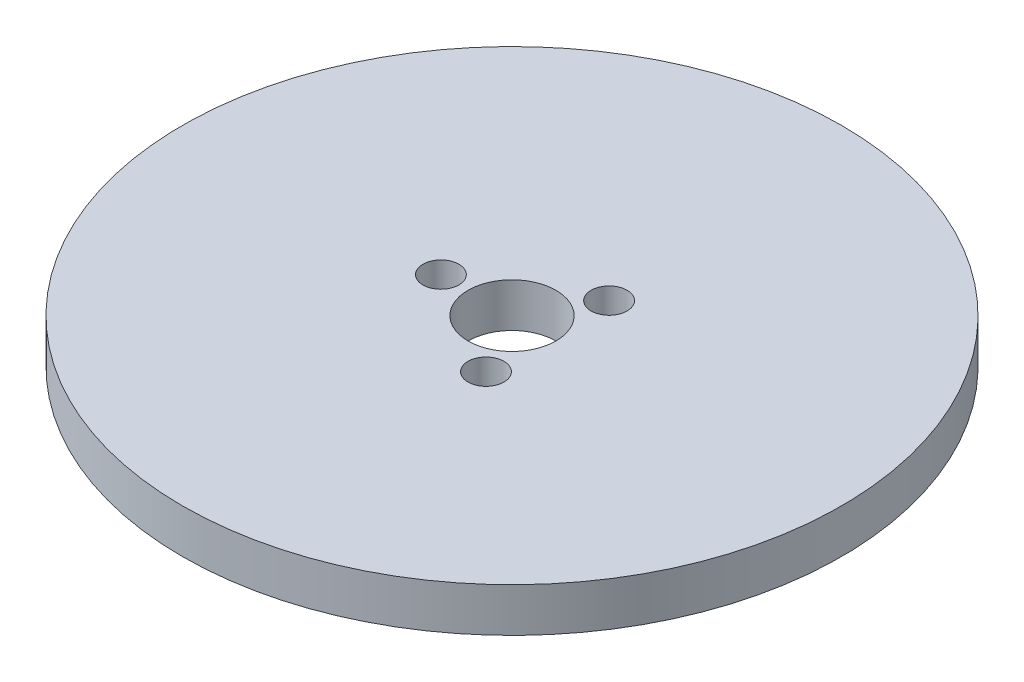
ISO-10303-21;
HEADER;
FILE_DESCRIPTION(('STEP AP214'),'2;1');
FILE_NAME('part.step','',(''),(''),'','','');
FILE_SCHEMA(('AUTOMOTIVE_DESIGN { 1 0 10303 214 1 1 1 1 }'));
ENDSEC;
DATA;
#1=APPLICATION_CONTEXT('core data for automotive mechanical design processes');
#2=APPLICATION_PROTOCOL_DEFINITION('international standard','automotive_design',2000,#1);
#3=PRODUCT_CONTEXT('',#1,'mechanical');
#4=PRODUCT('Part','Part','',(#3));
#5=PRODUCT_RELATED_PRODUCT_CATEGORY('part','',(#4));
#6=PRODUCT_DEFINITION_FORMATION('','',#4);
#7=PRODUCT_DEFINITION_CONTEXT('part definition',#1,'design');
#8=PRODUCT_DEFINITION('design','',#6,#7);
#9=PRODUCT_DEFINITION_SHAPE('','',#8);
#10=(LENGTH_UNIT() NAMED_UNIT(*) SI_UNIT(.MILLI.,.METRE.));
#11=(NAMED_UNIT(*) PLANE_ANGLE_UNIT() SI_UNIT($,.RADIAN.));
#12=(NAMED_UNIT(*) SI_UNIT($,.STERADIAN.) SOLID_ANGLE_UNIT());
#13=UNCERTAINTY_MEASURE_WITH_UNIT(LENGTH_MEASURE(1.E-05),#10,'distance_accuracy_value','');
#14=(GEOMETRIC_REPRESENTATION_CONTEXT(3) GLOBAL_UNCERTAINTY_ASSIGNED_CONTEXT((#13)) GLOBAL_UNIT_ASSIGNED_CONTEXT((#10,
#11,#12)) REPRESENTATION_CONTEXT('',''));
#15=CARTESIAN_POINT('',(0.,0.,0.));
#16=DIRECTION('',(0.,0.,1.));
#17=DIRECTION('',(1.,0.,0.));
#18=AXIS2_PLACEMENT_3D('',#15,#16,#17);
#19=CARTESIAN_POINT('',(0.,10.,0.));
#20=DIRECTION('',(0.,-1.,0.));
#21=DIRECTION('',(0.,0.,-1.));
#22=AXIS2_PLACEMENT_3D('',#19,#20,#21);
#23=CYLINDRICAL_SURFACE('',#22,75.);
#24=CARTESIAN_POINT('',(0.,10.,0.));
#25=DIRECTION('',(0.,1.,0.));
#26=DIRECTION('',(0.,0.,1.));
#27=AXIS2_PLACEMENT_3D('',#24,#25,#26);
#28=CIRCLE('',#27,75.);
#29=CARTESIAN_POINT('',(0.,10.,75.));
#30=VERTEX_POINT('',#29);
#31=EDGE_CURVE('E10',#30,#30,#28,.T.);
#32=ORIENTED_EDGE('',*,*,#31,.F.);
#33=EDGE_LOOP('',(#32));
#34=FACE_BOUND('',#33,.T.);
#35=CARTESIAN_POINT('',(0.,0.,0.));
#36=DIRECTION('',(0.,1.,0.));
#37=DIRECTION('',(0.,0.,1.));
#38=AXIS2_PLACEMENT_3D('',#35,#36,#37);
#39=CIRCLE('',#38,75.);
#40=CARTESIAN_POINT('',(0.,0.,75.));
#41=VERTEX_POINT('',#40);
#42=EDGE_CURVE('E37',#41,#41,#39,.T.);
#43=ORIENTED_EDGE('',*,*,#42,.T.);
#44=EDGE_LOOP('',(#43));
#45=FACE_BOUND('',#44,.T.);
#46=ADVANCED_FACE('F40',(#34,#45),#23,.T.);
#47=CARTESIAN_POINT('',(0.,10.,0.));
#48=DIRECTION('',(0.,1.,0.));
#49=DIRECTION('',(0.,0.,1.));
#50=AXIS2_PLACEMENT_3D('',#47,#48,#49);
#51=PLANE('',#50);
#52=CARTESIAN_POINT('',(8.08851748673285,10.,14.0097232449305));
#53=DIRECTION('',(0.,1.,0.));
#54=DIRECTION('',(0.866025403784436,0.,-0.500000000000004));
#55=AXIS2_PLACEMENT_3D('',#52,#53,#54);
#56=CIRCLE('',#55,4.09381448176856);
#57=CARTESIAN_POINT('',(11.633864826325,10.,11.9628160040462));
#58=VERTEX_POINT('',#57);
#59=EDGE_CURVE('E70',#58,#58,#56,.T.);
#60=ORIENTED_EDGE('',*,*,#59,.F.);
#61=EDGE_LOOP('',(#60));
#62=FACE_BOUND('',#61,.T.);
#63=CARTESIAN_POINT('',(8.08851748673266,10.,-14.0097232449306));
#64=DIRECTION('',(0.,1.,0.));
#65=DIRECTION('',(-0.866025403784443,0.,-0.499999999999992));
#66=AXIS2_PLACEMENT_3D('',#63,#64,#65);
#67=CIRCLE('',#66,4.09381448176856);
#68=CARTESIAN_POINT('',(4.54317014714044,10.,-16.0566304858148));
#69=VERTEX_POINT('',#68);
#70=EDGE_CURVE('E61',#69,#69,#67,.T.);
#71=ORIENTED_EDGE('',*,*,#70,.F.);
#72=EDGE_LOOP('',(#71));
#73=FACE_BOUND('',#72,.T.);
#74=CARTESIAN_POINT('',(-16.1770349734656,10.,0.));
#75=DIRECTION('',(0.,1.,0.));
#76=DIRECTION('',(0.,0.,1.));
#77=AXIS2_PLACEMENT_3D('',#74,#75,#76);
#78=CIRCLE('',#77,4.09381448176856);
#79=CARTESIAN_POINT('',(-16.1770349734656,10.,4.09381448176856));
#80=VERTEX_POINT('',#79);
#81=EDGE_CURVE('E54',#80,#80,#78,.T.);
#82=ORIENTED_EDGE('',*,*,#81,.F.);
#83=EDGE_LOOP('',(#82));
#84=FACE_BOUND('',#83,.T.);
#85=CARTESIAN_POINT('',(0.,10.,0.));
#86=DIRECTION('',(0.,1.,0.));
#87=DIRECTION('',(0.,0.,1.));
#88=AXIS2_PLACEMENT_3D('',#85,#86,#87);
#89=CIRCLE('',#88,10.);
#90=CARTESIAN_POINT('',(0.,10.,10.));
#91=VERTEX_POINT('',#90);
#92=EDGE_CURVE('E50',#91,#91,#89,.T.);
#93=ORIENTED_EDGE('',*,*,#92,.F.);
#94=EDGE_LOOP('',(#93));
#95=FACE_BOUND('',#94,.T.);
#96=ORIENTED_EDGE('',*,*,#31,.T.);
#97=EDGE_LOOP('',(#96));
#98=FACE_BOUND('',#97,.T.);
#99=ADVANCED_FACE('F85',(#62,#73,#84,#95,#98),#51,.T.);
#100=CARTESIAN_POINT('',(0.,0.,0.));
#101=DIRECTION('',(0.,1.,0.));
#102=DIRECTION('',(0.,0.,1.));
#103=AXIS2_PLACEMENT_3D('',#100,#101,#102);
#104=PLANE('',#103);
#105=CARTESIAN_POINT('',(0.,0.,0.));
#106=DIRECTION('',(0.,1.,0.));
#107=DIRECTION('',(0.,0.,1.));
#108=AXIS2_PLACEMENT_3D('',#105,#106,#107);
#109=CIRCLE('',#108,10.);
#110=CARTESIAN_POINT('',(0.,0.,10.));
#111=VERTEX_POINT('',#110);
#112=EDGE_CURVE('E47',#111,#111,#109,.T.);
#113=ORIENTED_EDGE('',*,*,#112,.T.);
#114=EDGE_LOOP('',(#113));
#115=FACE_BOUND('',#114,.T.);
#116=ORIENTED_EDGE('',*,*,#42,.F.);
#117=EDGE_LOOP('',(#116));
#118=FACE_BOUND('',#117,.T.);
#119=ADVANCED_FACE('F84',(#115,#118),#104,.F.);
#120=CARTESIAN_POINT('',(0.,10.,0.));
#121=DIRECTION('',(0.,-1.,0.));
#122=DIRECTION('',(0.,0.,-1.));
#123=AXIS2_PLACEMENT_3D('',#120,#121,#122);
#124=CYLINDRICAL_SURFACE('',#123,10.);
#125=ORIENTED_EDGE('',*,*,#92,.T.);
#126=EDGE_LOOP('',(#125));
#127=FACE_BOUND('',#126,.T.);
#128=ORIENTED_EDGE('',*,*,#112,.F.);
#129=EDGE_LOOP('',(#128));
#130=FACE_BOUND('',#129,.T.);
#131=ADVANCED_FACE('F91',(#127,#130),#124,.F.);
#132=CARTESIAN_POINT('',(-16.1770349734656,3.95859087083147,0.));
#133=DIRECTION('',(0.,1.,0.));
#134=DIRECTION('',(0.,0.,1.));
#135=AXIS2_PLACEMENT_3D('',#132,#133,#134);
#136=CYLINDRICAL_SURFACE('',#135,4.09381448176856);
#137=CARTESIAN_POINT('',(-16.1770349734656,3.95859087083147,0.));
#138=DIRECTION('',(0.,1.,0.));
#139=DIRECTION('',(0.,0.,1.));
#140=AXIS2_PLACEMENT_3D('',#137,#138,#139);
#141=CIRCLE('',#140,4.09381448176856);
#142=CARTESIAN_POINT('',(-16.1770349734656,3.95859087083147,4.09381448176856));
#143=VERTEX_POINT('',#142);
#144=EDGE_CURVE('E55',#143,#143,#141,.T.);
#145=ORIENTED_EDGE('',*,*,#144,.F.);
#146=EDGE_LOOP('',(#145));
#147=FACE_BOUND('',#146,.T.);
#148=ORIENTED_EDGE('',*,*,#81,.T.);
#149=EDGE_LOOP('',(#148));
#150=FACE_BOUND('',#149,.T.);
#151=ADVANCED_FACE('F96',(#147,#150),#136,.F.);
#152=CARTESIAN_POINT('',(-16.1770349734656,3.95859087083147,0.));
#153=DIRECTION('',(0.,1.,0.));
#154=DIRECTION('',(0.,0.,1.));
#155=AXIS2_PLACEMENT_3D('',#152,#153,#154);
#156=PLANE('',#155);
#157=ORIENTED_EDGE('',*,*,#144,.T.);
#158=EDGE_LOOP('',(#157));
#159=FACE_BOUND('',#158,.T.);
#160=ADVANCED_FACE('F127',(#159),#156,.T.);
#161=CARTESIAN_POINT('',(8.08851748673266,3.95859087083147,-14.0097232449306));
#162=DIRECTION('',(0.,1.,0.));
#163=DIRECTION('',(0.,0.,1.));
#164=AXIS2_PLACEMENT_3D('',#161,#162,#163);
#165=CYLINDRICAL_SURFACE('',#164,4.09381448176856);
#166=CARTESIAN_POINT('',(8.08851748673266,3.95859087083147,-14.0097232449306));
#167=DIRECTION('',(0.,1.,0.));
#168=DIRECTION('',(-0.866025403784443,0.,-0.499999999999992));
#169=AXIS2_PLACEMENT_3D('',#166,#167,#168);
#170=CIRCLE('',#169,4.09381448176856);
#171=CARTESIAN_POINT('',(4.54317014714044,3.95859087083147,-16.0566304858148));
#172=VERTEX_POINT('',#171);
#173=EDGE_CURVE('E63',#172,#172,#170,.T.);
#174=ORIENTED_EDGE('',*,*,#173,.F.);
#175=EDGE_LOOP('',(#174));
#176=FACE_BOUND('',#175,.T.);
#177=ORIENTED_EDGE('',*,*,#70,.T.);
#178=EDGE_LOOP('',(#177));
#179=FACE_BOUND('',#178,.T.);
#180=ADVANCED_FACE('F133',(#176,#179),#165,.F.);
#181=CARTESIAN_POINT('',(8.08851748673266,3.95859087083147,-14.0097232449306));
#182=DIRECTION('',(0.,1.,0.));
#183=DIRECTION('',(-0.866025403784443,0.,-0.499999999999992));
#184=AXIS2_PLACEMENT_3D('',#181,#182,#183);
#185=PLANE('',#184);
#186=ORIENTED_EDGE('',*,*,#173,.T.);
#187=EDGE_LOOP('',(#186));
#188=FACE_BOUND('',#187,.T.);
#189=ADVANCED_FACE('F77',(#188),#185,.T.);
#190=CARTESIAN_POINT('',(8.08851748673285,3.95859087083147,14.0097232449305));
#191=DIRECTION('',(0.,1.,0.));
#192=DIRECTION('',(0.,0.,1.));
#193=AXIS2_PLACEMENT_3D('',#190,#191,#192);
#194=CYLINDRICAL_SURFACE('',#193,4.09381448176856);
#195=CARTESIAN_POINT('',(8.08851748673285,3.95859087083147,14.0097232449305));
#196=DIRECTION('',(0.,1.,0.));
#197=DIRECTION('',(0.866025403784436,0.,-0.500000000000004));
#198=AXIS2_PLACEMENT_3D('',#195,#196,#197);
#199=CIRCLE('',#198,4.09381448176856);
#200=CARTESIAN_POINT('',(11.633864826325,3.95859087083147,11.9628160040462));
#201=VERTEX_POINT('',#200);
#202=EDGE_CURVE('E59',#201,#201,#199,.T.);
#203=ORIENTED_EDGE('',*,*,#202,.F.);
#204=EDGE_LOOP('',(#203));
#205=FACE_BOUND('',#204,.T.);
#206=ORIENTED_EDGE('',*,*,#59,.T.);
#207=EDGE_LOOP('',(#206));
#208=FACE_BOUND('',#207,.T.);
#209=ADVANCED_FACE('F73',(#205,#208),#194,.F.);
#210=CARTESIAN_POINT('',(8.08851748673285,3.95859087083147,14.0097232449305));
#211=DIRECTION('',(0.,1.,0.));
#212=DIRECTION('',(0.866025403784436,0.,-0.500000000000004));
#213=AXIS2_PLACEMENT_3D('',#210,#211,#212);
#214=PLANE('',#213);
#215=ORIENTED_EDGE('',*,*,#202,.T.);
#216=EDGE_LOOP('',(#215));
#217=FACE_BOUND('',#216,.T.);
#218=ADVANCED_FACE('F71',(#217),#214,.T.);
#219=CLOSED_SHELL('',(#46,#99,#119,#131,#151,#160,#180,#189,#209,#218));
#220=MANIFOLD_SOLID_BREP('B2',#219);
#221=ADVANCED_BREP_SHAPE_REPRESENTATION('',(#18,#220),#14);
#222=SHAPE_DEFINITION_REPRESENTATION(#9,#221);
ENDSEC;
END-ISO-10303-21;
